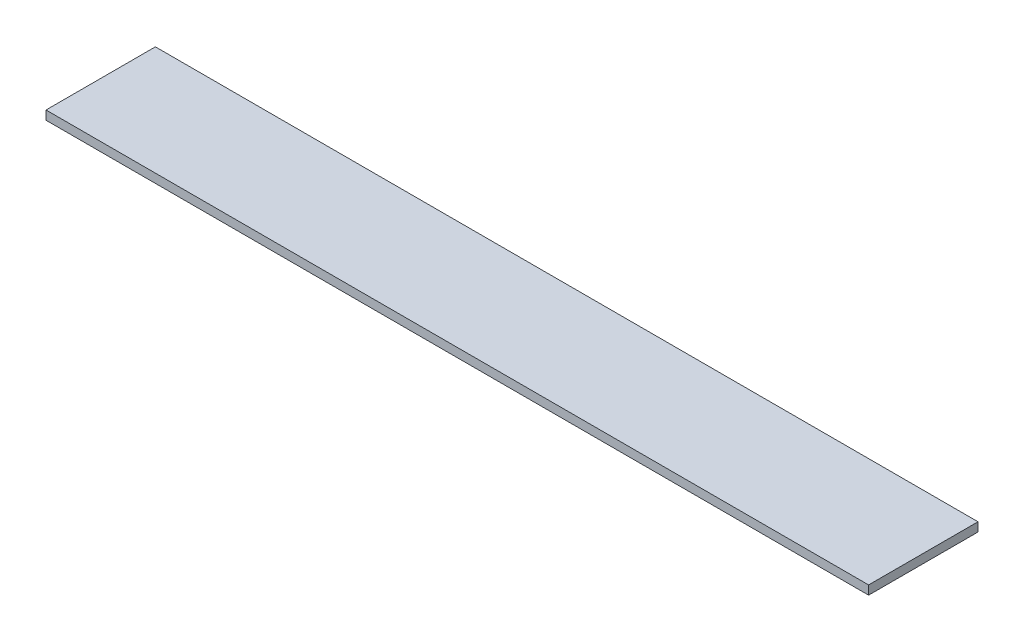
ISO-10303-21;
HEADER;
FILE_DESCRIPTION(('STEP AP214'),'2;1');
FILE_NAME('part.step','',(''),(''),'','','');
FILE_SCHEMA(('AUTOMOTIVE_DESIGN { 1 0 10303 214 1 1 1 1 }'));
ENDSEC;
DATA;
#1=APPLICATION_CONTEXT('core data for automotive mechanical design processes');
#2=APPLICATION_PROTOCOL_DEFINITION('international standard','automotive_design',2000,#1);
#3=PRODUCT_CONTEXT('',#1,'mechanical');
#4=PRODUCT('Part','Part','',(#3));
#5=PRODUCT_RELATED_PRODUCT_CATEGORY('part','',(#4));
#6=PRODUCT_DEFINITION_FORMATION('','',#4);
#7=PRODUCT_DEFINITION_CONTEXT('part definition',#1,'design');
#8=PRODUCT_DEFINITION('design','',#6,#7);
#9=PRODUCT_DEFINITION_SHAPE('','',#8);
#10=(LENGTH_UNIT() NAMED_UNIT(*) SI_UNIT(.MILLI.,.METRE.));
#11=(NAMED_UNIT(*) PLANE_ANGLE_UNIT() SI_UNIT($,.RADIAN.));
#12=(NAMED_UNIT(*) SI_UNIT($,.STERADIAN.) SOLID_ANGLE_UNIT());
#13=UNCERTAINTY_MEASURE_WITH_UNIT(LENGTH_MEASURE(1.E-05),#10,'distance_accuracy_value','');
#14=(GEOMETRIC_REPRESENTATION_CONTEXT(3) GLOBAL_UNCERTAINTY_ASSIGNED_CONTEXT((#13)) GLOBAL_UNIT_ASSIGNED_CONTEXT((#10,
#11,#12)) REPRESENTATION_CONTEXT('',''));
#15=CARTESIAN_POINT('',(0.,0.,0.));
#16=DIRECTION('',(0.,0.,1.));
#17=DIRECTION('',(1.,0.,0.));
#18=AXIS2_PLACEMENT_3D('',#15,#16,#17);
#19=CARTESIAN_POINT('',(0.,1.,0.));
#20=DIRECTION('',(1.,0.,0.));
#21=DIRECTION('',(0.,0.,-1.));
#22=AXIS2_PLACEMENT_3D('',#19,#20,#21);
#23=PLANE('',#22);
#24=DIRECTION('',(0.,0.,1.));
#25=VECTOR('',#24,1.);
#26=CARTESIAN_POINT('',(0.,0.,0.));
#27=LINE('',#26,#25);
#28=CARTESIAN_POINT('',(0.,0.,-12.3));
#29=VERTEX_POINT('',#28);
#30=CARTESIAN_POINT('',(0.,0.,0.));
#31=VERTEX_POINT('',#30);
#32=EDGE_CURVE('E96',#29,#31,#27,.T.);
#33=ORIENTED_EDGE('',*,*,#32,.T.);
#34=DIRECTION('',(0.,-1.,0.));
#35=VECTOR('',#34,1.);
#36=CARTESIAN_POINT('',(0.,1.,0.));
#37=LINE('',#36,#35);
#38=CARTESIAN_POINT('',(0.,1.,0.));
#39=VERTEX_POINT('',#38);
#40=EDGE_CURVE('E11',#39,#31,#37,.T.);
#41=ORIENTED_EDGE('',*,*,#40,.F.);
#42=DIRECTION('',(0.,0.,1.));
#43=VECTOR('',#42,1.);
#44=CARTESIAN_POINT('',(0.,1.,0.));
#45=LINE('',#44,#43);
#46=CARTESIAN_POINT('',(0.,1.,-12.3));
#47=VERTEX_POINT('',#46);
#48=EDGE_CURVE('E84',#47,#39,#45,.T.);
#49=ORIENTED_EDGE('',*,*,#48,.F.);
#50=DIRECTION('',(0.,-1.,0.));
#51=VECTOR('',#50,1.);
#52=CARTESIAN_POINT('',(0.,1.,-12.3));
#53=LINE('',#52,#51);
#54=EDGE_CURVE('E92',#47,#29,#53,.T.);
#55=ORIENTED_EDGE('',*,*,#54,.T.);
#56=EDGE_LOOP('',(#33,#41,#49,#55));
#57=FACE_BOUND('',#56,.T.);
#58=ADVANCED_FACE('F33',(#57),#23,.F.);
#59=CARTESIAN_POINT('',(0.,1.,0.));
#60=DIRECTION('',(0.,0.,-1.));
#61=DIRECTION('',(-1.,0.,0.));
#62=AXIS2_PLACEMENT_3D('',#59,#60,#61);
#63=PLANE('',#62);
#64=DIRECTION('',(1.,0.,0.));
#65=VECTOR('',#64,1.);
#66=CARTESIAN_POINT('',(0.,0.,0.));
#67=LINE('',#66,#65);
#68=CARTESIAN_POINT('',(92.5,0.,0.));
#69=VERTEX_POINT('',#68);
#70=EDGE_CURVE('E88',#31,#69,#67,.T.);
#71=ORIENTED_EDGE('',*,*,#70,.T.);
#72=DIRECTION('',(0.,-1.,0.));
#73=VECTOR('',#72,1.);
#74=CARTESIAN_POINT('',(92.5,1.,0.));
#75=LINE('',#74,#73);
#76=CARTESIAN_POINT('',(92.5,1.,0.));
#77=VERTEX_POINT('',#76);
#78=EDGE_CURVE('E41',#77,#69,#75,.T.);
#79=ORIENTED_EDGE('',*,*,#78,.F.);
#80=DIRECTION('',(1.,0.,0.));
#81=VECTOR('',#80,1.);
#82=CARTESIAN_POINT('',(0.,1.,0.));
#83=LINE('',#82,#81);
#84=EDGE_CURVE('E79',#39,#77,#83,.T.);
#85=ORIENTED_EDGE('',*,*,#84,.F.);
#86=ORIENTED_EDGE('',*,*,#40,.T.);
#87=EDGE_LOOP('',(#71,#79,#85,#86));
#88=FACE_BOUND('',#87,.T.);
#89=ADVANCED_FACE('F87',(#88),#63,.F.);
#90=CARTESIAN_POINT('',(92.5,1.,0.));
#91=DIRECTION('',(-1.,0.,0.));
#92=DIRECTION('',(0.,0.,1.));
#93=AXIS2_PLACEMENT_3D('',#90,#91,#92);
#94=PLANE('',#93);
#95=DIRECTION('',(0.,0.,-1.));
#96=VECTOR('',#95,1.);
#97=CARTESIAN_POINT('',(92.5,0.,0.));
#98=LINE('',#97,#96);
#99=CARTESIAN_POINT('',(92.5,0.,-12.3));
#100=VERTEX_POINT('',#99);
#101=EDGE_CURVE('E66',#69,#100,#98,.T.);
#102=ORIENTED_EDGE('',*,*,#101,.T.);
#103=DIRECTION('',(0.,-1.,0.));
#104=VECTOR('',#103,1.);
#105=CARTESIAN_POINT('',(92.5,1.,-12.3));
#106=LINE('',#105,#104);
#107=CARTESIAN_POINT('',(92.5,1.,-12.3));
#108=VERTEX_POINT('',#107);
#109=EDGE_CURVE('E89',#108,#100,#106,.T.);
#110=ORIENTED_EDGE('',*,*,#109,.F.);
#111=DIRECTION('',(0.,0.,-1.));
#112=VECTOR('',#111,1.);
#113=CARTESIAN_POINT('',(92.5,1.,0.));
#114=LINE('',#113,#112);
#115=EDGE_CURVE('E82',#77,#108,#114,.T.);
#116=ORIENTED_EDGE('',*,*,#115,.F.);
#117=ORIENTED_EDGE('',*,*,#78,.T.);
#118=EDGE_LOOP('',(#102,#110,#116,#117));
#119=FACE_BOUND('',#118,.T.);
#120=ADVANCED_FACE('F90',(#119),#94,.F.);
#121=CARTESIAN_POINT('',(0.,1.,-12.3));
#122=DIRECTION('',(0.,0.,1.));
#123=DIRECTION('',(1.,0.,0.));
#124=AXIS2_PLACEMENT_3D('',#121,#122,#123);
#125=PLANE('',#124);
#126=DIRECTION('',(-1.,0.,0.));
#127=VECTOR('',#126,1.);
#128=CARTESIAN_POINT('',(0.,0.,-12.3));
#129=LINE('',#128,#127);
#130=EDGE_CURVE('E72',#100,#29,#129,.T.);
#131=ORIENTED_EDGE('',*,*,#130,.T.);
#132=ORIENTED_EDGE('',*,*,#54,.F.);
#133=DIRECTION('',(-1.,0.,0.));
#134=VECTOR('',#133,1.);
#135=CARTESIAN_POINT('',(0.,1.,-12.3));
#136=LINE('',#135,#134);
#137=EDGE_CURVE('E49',#108,#47,#136,.T.);
#138=ORIENTED_EDGE('',*,*,#137,.F.);
#139=ORIENTED_EDGE('',*,*,#109,.T.);
#140=EDGE_LOOP('',(#131,#132,#138,#139));
#141=FACE_BOUND('',#140,.T.);
#142=ADVANCED_FACE('F103',(#141),#125,.F.);
#143=CARTESIAN_POINT('',(0.,1.,0.));
#144=DIRECTION('',(0.,-1.,0.));
#145=DIRECTION('',(0.,0.,-1.));
#146=AXIS2_PLACEMENT_3D('',#143,#144,#145);
#147=PLANE('',#146);
#148=ORIENTED_EDGE('',*,*,#48,.T.);
#149=ORIENTED_EDGE('',*,*,#84,.T.);
#150=ORIENTED_EDGE('',*,*,#115,.T.);
#151=ORIENTED_EDGE('',*,*,#137,.T.);
#152=EDGE_LOOP('',(#148,#149,#150,#151));
#153=FACE_BOUND('',#152,.T.);
#154=ADVANCED_FACE('F80',(#153),#147,.F.);
#155=CARTESIAN_POINT('',(0.,0.,0.));
#156=DIRECTION('',(0.,-1.,0.));
#157=DIRECTION('',(0.,0.,-1.));
#158=AXIS2_PLACEMENT_3D('',#155,#156,#157);
#159=PLANE('',#158);
#160=ORIENTED_EDGE('',*,*,#32,.F.);
#161=ORIENTED_EDGE('',*,*,#130,.F.);
#162=ORIENTED_EDGE('',*,*,#101,.F.);
#163=ORIENTED_EDGE('',*,*,#70,.F.);
#164=EDGE_LOOP('',(#160,#161,#162,#163));
#165=FACE_BOUND('',#164,.T.);
#166=ADVANCED_FACE('F106',(#165),#159,.T.);
#167=CLOSED_SHELL('',(#58,#89,#120,#142,#154,#166));
#168=MANIFOLD_SOLID_BREP('B2',#167);
#169=ADVANCED_BREP_SHAPE_REPRESENTATION('',(#18,#168),#14);
#170=SHAPE_DEFINITION_REPRESENTATION(#9,#169);
ENDSEC;
END-ISO-10303-21;
